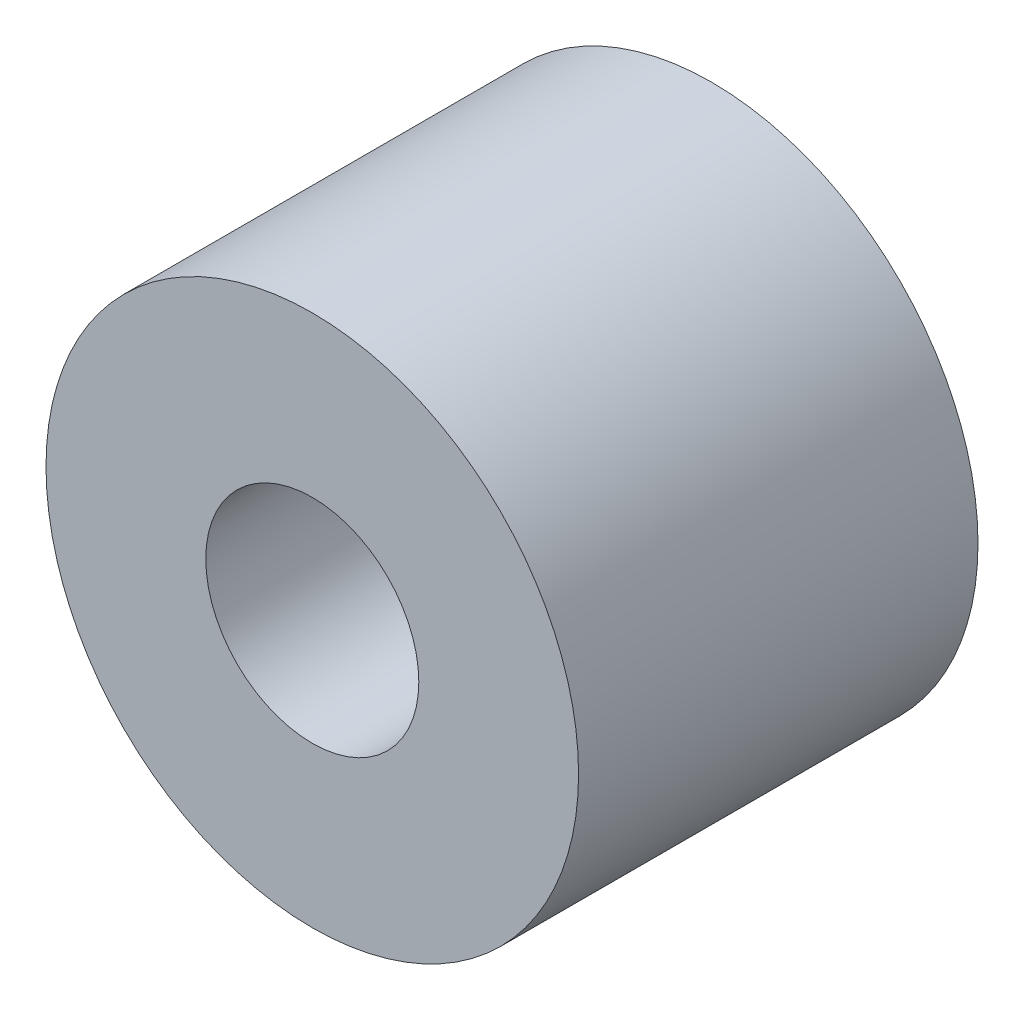
ISO-10303-21;
HEADER;
FILE_DESCRIPTION(('STEP AP214'),'2;1');
FILE_NAME('part.step','',(''),(''),'','','');
FILE_SCHEMA(('AUTOMOTIVE_DESIGN { 1 0 10303 214 1 1 1 1 }'));
ENDSEC;
DATA;
#1=APPLICATION_CONTEXT('core data for automotive mechanical design processes');
#2=APPLICATION_PROTOCOL_DEFINITION('international standard','automotive_design',2000,#1);
#3=PRODUCT_CONTEXT('',#1,'mechanical');
#4=PRODUCT('Part','Part','',(#3));
#5=PRODUCT_RELATED_PRODUCT_CATEGORY('part','',(#4));
#6=PRODUCT_DEFINITION_FORMATION('','',#4);
#7=PRODUCT_DEFINITION_CONTEXT('part definition',#1,'design');
#8=PRODUCT_DEFINITION('design','',#6,#7);
#9=PRODUCT_DEFINITION_SHAPE('','',#8);
#10=(LENGTH_UNIT() NAMED_UNIT(*) SI_UNIT(.MILLI.,.METRE.));
#11=(NAMED_UNIT(*) PLANE_ANGLE_UNIT() SI_UNIT($,.RADIAN.));
#12=(NAMED_UNIT(*) SI_UNIT($,.STERADIAN.) SOLID_ANGLE_UNIT());
#13=UNCERTAINTY_MEASURE_WITH_UNIT(LENGTH_MEASURE(1.E-05),#10,'distance_accuracy_value','');
#14=(GEOMETRIC_REPRESENTATION_CONTEXT(3) GLOBAL_UNCERTAINTY_ASSIGNED_CONTEXT((#13)) GLOBAL_UNIT_ASSIGNED_CONTEXT((#10,
#11,#12)) REPRESENTATION_CONTEXT('',''));
#15=CARTESIAN_POINT('',(0.,0.,0.));
#16=DIRECTION('',(0.,0.,1.));
#17=DIRECTION('',(1.,0.,0.));
#18=AXIS2_PLACEMENT_3D('',#15,#16,#17);
#19=CARTESIAN_POINT('',(0.,0.,15.));
#20=DIRECTION('',(0.,0.,1.));
#21=DIRECTION('',(1.,0.,0.));
#22=AXIS2_PLACEMENT_3D('',#19,#20,#21);
#23=PLANE('',#22);
#24=CARTESIAN_POINT('',(0.,0.,15.));
#25=DIRECTION('',(0.,0.,1.));
#26=DIRECTION('',(1.,0.,0.));
#27=AXIS2_PLACEMENT_3D('',#24,#25,#26);
#28=CIRCLE('',#27,10.);
#29=CARTESIAN_POINT('',(10.,0.,15.));
#30=VERTEX_POINT('',#29);
#31=EDGE_CURVE('E10',#30,#30,#28,.T.);
#32=ORIENTED_EDGE('',*,*,#31,.T.);
#33=EDGE_LOOP('',(#32));
#34=FACE_BOUND('',#33,.T.);
#35=CARTESIAN_POINT('',(0.,0.,15.));
#36=DIRECTION('',(0.,0.,1.));
#37=DIRECTION('',(1.,0.,0.));
#38=AXIS2_PLACEMENT_3D('',#35,#36,#37);
#39=CIRCLE('',#38,4.);
#40=CARTESIAN_POINT('',(4.,0.,15.));
#41=VERTEX_POINT('',#40);
#42=EDGE_CURVE('E46',#41,#41,#39,.T.);
#43=ORIENTED_EDGE('',*,*,#42,.F.);
#44=EDGE_LOOP('',(#43));
#45=FACE_BOUND('',#44,.T.);
#46=ADVANCED_FACE('F35',(#34,#45),#23,.T.);
#47=CARTESIAN_POINT('',(0.,0.,0.));
#48=DIRECTION('',(0.,0.,1.));
#49=DIRECTION('',(1.,0.,0.));
#50=AXIS2_PLACEMENT_3D('',#47,#48,#49);
#51=PLANE('',#50);
#52=CARTESIAN_POINT('',(0.,0.,0.));
#53=DIRECTION('',(0.,0.,1.));
#54=DIRECTION('',(1.,0.,0.));
#55=AXIS2_PLACEMENT_3D('',#52,#53,#54);
#56=CIRCLE('',#55,10.);
#57=CARTESIAN_POINT('',(10.,0.,0.));
#58=VERTEX_POINT('',#57);
#59=EDGE_CURVE('E39',#58,#58,#56,.T.);
#60=ORIENTED_EDGE('',*,*,#59,.F.);
#61=EDGE_LOOP('',(#60));
#62=FACE_BOUND('',#61,.T.);
#63=CARTESIAN_POINT('',(0.,0.,0.));
#64=DIRECTION('',(0.,0.,1.));
#65=DIRECTION('',(1.,0.,0.));
#66=AXIS2_PLACEMENT_3D('',#63,#64,#65);
#67=CIRCLE('',#66,4.);
#68=CARTESIAN_POINT('',(4.,0.,0.));
#69=VERTEX_POINT('',#68);
#70=EDGE_CURVE('E48',#69,#69,#67,.T.);
#71=ORIENTED_EDGE('',*,*,#70,.T.);
#72=EDGE_LOOP('',(#71));
#73=FACE_BOUND('',#72,.T.);
#74=ADVANCED_FACE('F58',(#62,#73),#51,.F.);
#75=CARTESIAN_POINT('',(0.,0.,15.));
#76=DIRECTION('',(0.,0.,-1.));
#77=DIRECTION('',(-1.,0.,0.));
#78=AXIS2_PLACEMENT_3D('',#75,#76,#77);
#79=CYLINDRICAL_SURFACE('',#78,10.);
#80=ORIENTED_EDGE('',*,*,#31,.F.);
#81=EDGE_LOOP('',(#80));
#82=FACE_BOUND('',#81,.T.);
#83=ORIENTED_EDGE('',*,*,#59,.T.);
#84=EDGE_LOOP('',(#83));
#85=FACE_BOUND('',#84,.T.);
#86=ADVANCED_FACE('F37',(#82,#85),#79,.T.);
#87=CARTESIAN_POINT('',(0.,0.,15.));
#88=DIRECTION('',(0.,0.,-1.));
#89=DIRECTION('',(-1.,0.,0.));
#90=AXIS2_PLACEMENT_3D('',#87,#88,#89);
#91=CYLINDRICAL_SURFACE('',#90,4.);
#92=ORIENTED_EDGE('',*,*,#42,.T.);
#93=EDGE_LOOP('',(#92));
#94=FACE_BOUND('',#93,.T.);
#95=ORIENTED_EDGE('',*,*,#70,.F.);
#96=EDGE_LOOP('',(#95));
#97=FACE_BOUND('',#96,.T.);
#98=ADVANCED_FACE('F54',(#94,#97),#91,.F.);
#99=CLOSED_SHELL('',(#46,#74,#86,#98));
#100=MANIFOLD_SOLID_BREP('B2',#99);
#101=ADVANCED_BREP_SHAPE_REPRESENTATION('',(#18,#100),#14);
#102=SHAPE_DEFINITION_REPRESENTATION(#9,#101);
ENDSEC;
END-ISO-10303-21;
